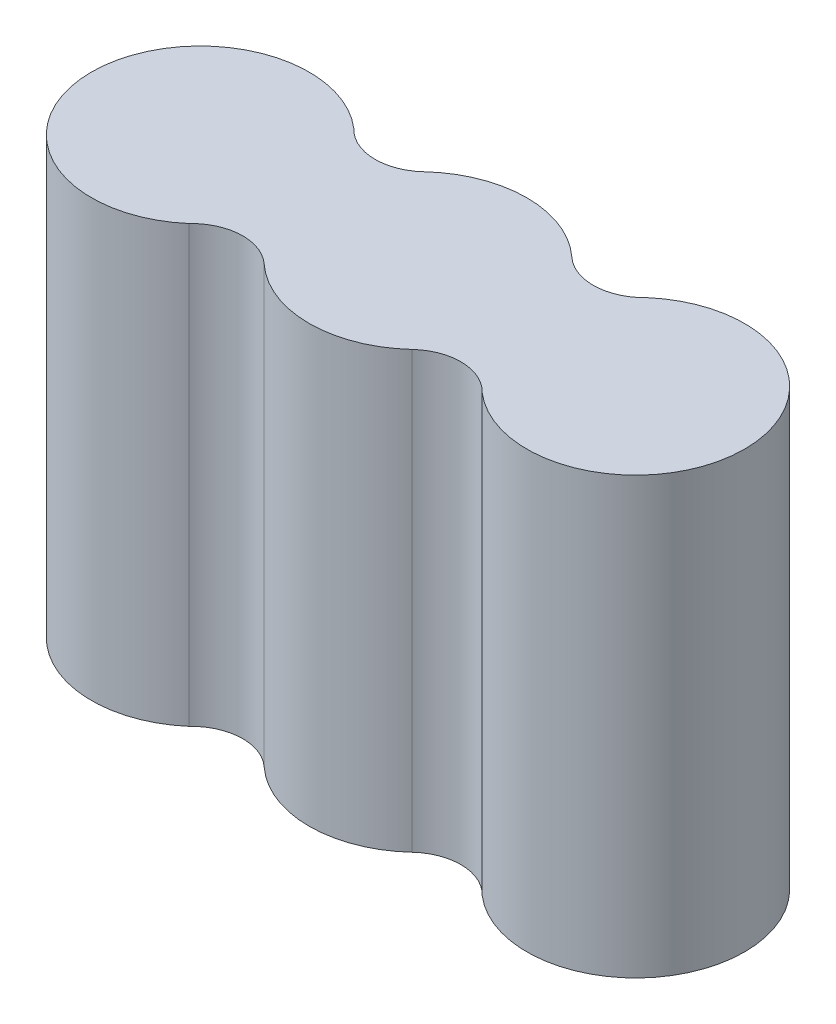
ISO-10303-21;
HEADER;
FILE_DESCRIPTION(('STEP AP214'),'2;1');
FILE_NAME('part.step','',(''),(''),'','','');
FILE_SCHEMA(('AUTOMOTIVE_DESIGN { 1 0 10303 214 1 1 1 1 }'));
ENDSEC;
DATA;
#1=APPLICATION_CONTEXT('core data for automotive mechanical design processes');
#2=APPLICATION_PROTOCOL_DEFINITION('international standard','automotive_design',2000,#1);
#3=PRODUCT_CONTEXT('',#1,'mechanical');
#4=PRODUCT('Part','Part','',(#3));
#5=PRODUCT_RELATED_PRODUCT_CATEGORY('part','',(#4));
#6=PRODUCT_DEFINITION_FORMATION('','',#4);
#7=PRODUCT_DEFINITION_CONTEXT('part definition',#1,'design');
#8=PRODUCT_DEFINITION('design','',#6,#7);
#9=PRODUCT_DEFINITION_SHAPE('','',#8);
#10=(LENGTH_UNIT() NAMED_UNIT(*) SI_UNIT(.MILLI.,.METRE.));
#11=(NAMED_UNIT(*) PLANE_ANGLE_UNIT() SI_UNIT($,.RADIAN.));
#12=(NAMED_UNIT(*) SI_UNIT($,.STERADIAN.) SOLID_ANGLE_UNIT());
#13=UNCERTAINTY_MEASURE_WITH_UNIT(LENGTH_MEASURE(1.E-05),#10,'distance_accuracy_value','');
#14=(GEOMETRIC_REPRESENTATION_CONTEXT(3) GLOBAL_UNCERTAINTY_ASSIGNED_CONTEXT((#13)) GLOBAL_UNIT_ASSIGNED_CONTEXT((#10,
#11,#12)) REPRESENTATION_CONTEXT('',''));
#15=CARTESIAN_POINT('',(0.,0.,0.));
#16=DIRECTION('',(0.,0.,1.));
#17=DIRECTION('',(1.,0.,0.));
#18=AXIS2_PLACEMENT_3D('',#15,#16,#17);
#19=CARTESIAN_POINT('',(7.50917892734011,30.,8.11492651155154));
#20=DIRECTION('',(0.,-1.,0.));
#21=DIRECTION('',(0.,0.,-1.));
#22=AXIS2_PLACEMENT_3D('',#19,#20,#21);
#23=CYLINDRICAL_SURFACE('',#22,3.55621094456377);
#24=CARTESIAN_POINT('',(7.50917892734011,0.,8.11492651155154));
#25=DIRECTION('',(0.,-1.,0.));
#26=DIRECTION('',(0.,0.,-1.));
#27=AXIS2_PLACEMENT_3D('',#24,#25,#26);
#28=CIRCLE('',#27,3.55621094456377);
#29=CARTESIAN_POINT('',(5.09386463748164,0.,5.504774568955));
#30=VERTEX_POINT('',#29);
#31=CARTESIAN_POINT('',(10.0956544191454,0.,5.67427479274238));
#32=VERTEX_POINT('',#31);
#33=EDGE_CURVE('E129',#30,#32,#28,.T.);
#34=ORIENTED_EDGE('',*,*,#33,.T.);
#35=DIRECTION('',(0.,-1.,0.));
#36=VECTOR('',#35,1.);
#37=CARTESIAN_POINT('',(10.0956544191454,30.,5.67427479274238));
#38=LINE('',#37,#36);
#39=CARTESIAN_POINT('',(10.0956544191454,30.,5.67427479274238));
#40=VERTEX_POINT('',#39);
#41=EDGE_CURVE('E11',#40,#32,#38,.T.);
#42=ORIENTED_EDGE('',*,*,#41,.F.);
#43=CARTESIAN_POINT('',(7.50917892734011,30.,8.11492651155154));
#44=DIRECTION('',(0.,-1.,0.));
#45=DIRECTION('',(0.,0.,-1.));
#46=AXIS2_PLACEMENT_3D('',#43,#44,#45);
#47=CIRCLE('',#46,3.55621094456377);
#48=CARTESIAN_POINT('',(5.09386463748164,30.,5.504774568955));
#49=VERTEX_POINT('',#48);
#50=EDGE_CURVE('E143',#49,#40,#47,.T.);
#51=ORIENTED_EDGE('',*,*,#50,.F.);
#52=DIRECTION('',(0.,-1.,0.));
#53=VECTOR('',#52,1.);
#54=CARTESIAN_POINT('',(5.09386463748164,30.,5.504774568955));
#55=LINE('',#54,#53);
#56=EDGE_CURVE('E125',#49,#30,#55,.T.);
#57=ORIENTED_EDGE('',*,*,#56,.T.);
#58=EDGE_LOOP('',(#34,#42,#51,#57));
#59=FACE_BOUND('',#58,.T.);
#60=ADVANCED_FACE('F33',(#59),#23,.F.);
#61=CARTESIAN_POINT('',(15.,30.,0.));
#62=DIRECTION('',(0.,-1.,0.));
#63=DIRECTION('',(0.,0.,-1.));
#64=AXIS2_PLACEMENT_3D('',#61,#62,#63);
#65=CYLINDRICAL_SURFACE('',#64,7.5);
#66=CARTESIAN_POINT('',(15.,0.,0.));
#67=DIRECTION('',(0.,1.,0.));
#68=DIRECTION('',(0.,0.,1.));
#69=AXIS2_PLACEMENT_3D('',#66,#67,#68);
#70=CIRCLE('',#69,7.5);
#71=CARTESIAN_POINT('',(10.0956544191453,0.,-5.67427479274239));
#72=VERTEX_POINT('',#71);
#73=EDGE_CURVE('E132',#32,#72,#70,.T.);
#74=ORIENTED_EDGE('',*,*,#73,.T.);
#75=DIRECTION('',(0.,-1.,0.));
#76=VECTOR('',#75,1.);
#77=CARTESIAN_POINT('',(10.0956544191453,30.,-5.67427479274239));
#78=LINE('',#77,#76);
#79=CARTESIAN_POINT('',(10.0956544191453,30.,-5.67427479274239));
#80=VERTEX_POINT('',#79);
#81=EDGE_CURVE('E41',#80,#72,#78,.T.);
#82=ORIENTED_EDGE('',*,*,#81,.F.);
#83=CARTESIAN_POINT('',(15.,30.,0.));
#84=DIRECTION('',(0.,1.,0.));
#85=DIRECTION('',(0.,0.,1.));
#86=AXIS2_PLACEMENT_3D('',#83,#84,#85);
#87=CIRCLE('',#86,7.5);
#88=EDGE_CURVE('E92',#40,#80,#87,.T.);
#89=ORIENTED_EDGE('',*,*,#88,.F.);
#90=ORIENTED_EDGE('',*,*,#41,.T.);
#91=EDGE_LOOP('',(#74,#82,#89,#90));
#92=FACE_BOUND('',#91,.T.);
#93=ADVANCED_FACE('F178',(#92),#65,.T.);
#94=CARTESIAN_POINT('',(7.50917892734011,30.,-8.11492651155154));
#95=DIRECTION('',(0.,-1.,0.));
#96=DIRECTION('',(0.,0.,-1.));
#97=AXIS2_PLACEMENT_3D('',#94,#95,#96);
#98=CYLINDRICAL_SURFACE('',#97,3.55621094456377);
#99=CARTESIAN_POINT('',(7.50917892734011,0.,-8.11492651155154));
#100=DIRECTION('',(0.,-1.,0.));
#101=DIRECTION('',(0.,0.,1.));
#102=AXIS2_PLACEMENT_3D('',#99,#100,#101);
#103=CIRCLE('',#102,3.55621094456377);
#104=CARTESIAN_POINT('',(5.09386463748164,0.,-5.504774568955));
#105=VERTEX_POINT('',#104);
#106=EDGE_CURVE('E134',#72,#105,#103,.T.);
#107=ORIENTED_EDGE('',*,*,#106,.T.);
#108=DIRECTION('',(0.,-1.,0.));
#109=VECTOR('',#108,1.);
#110=CARTESIAN_POINT('',(5.09386463748164,30.,-5.504774568955));
#111=LINE('',#110,#109);
#112=CARTESIAN_POINT('',(5.09386463748164,30.,-5.504774568955));
#113=VERTEX_POINT('',#112);
#114=EDGE_CURVE('E150',#113,#105,#111,.T.);
#115=ORIENTED_EDGE('',*,*,#114,.F.);
#116=CARTESIAN_POINT('',(7.50917892734011,30.,-8.11492651155154));
#117=DIRECTION('',(0.,-1.,0.));
#118=DIRECTION('',(0.,0.,1.));
#119=AXIS2_PLACEMENT_3D('',#116,#117,#118);
#120=CIRCLE('',#119,3.55621094456377);
#121=EDGE_CURVE('E158',#80,#113,#120,.T.);
#122=ORIENTED_EDGE('',*,*,#121,.F.);
#123=ORIENTED_EDGE('',*,*,#81,.T.);
#124=EDGE_LOOP('',(#107,#115,#122,#123));
#125=FACE_BOUND('',#124,.T.);
#126=ADVANCED_FACE('F156',(#125),#98,.F.);
#127=CARTESIAN_POINT('',(0.,30.,0.));
#128=DIRECTION('',(0.,-1.,0.));
#129=DIRECTION('',(0.,0.,-1.));
#130=AXIS2_PLACEMENT_3D('',#127,#128,#129);
#131=CYLINDRICAL_SURFACE('',#130,7.49999999999998);
#132=CARTESIAN_POINT('',(0.,0.,0.));
#133=DIRECTION('',(0.,1.,0.));
#134=DIRECTION('',(0.,0.,1.));
#135=AXIS2_PLACEMENT_3D('',#132,#133,#134);
#136=CIRCLE('',#135,7.49999999999998);
#137=CARTESIAN_POINT('',(-5.09386463748162,0.,-5.50477456895498));
#138=VERTEX_POINT('',#137);
#139=EDGE_CURVE('E136',#105,#138,#136,.T.);
#140=ORIENTED_EDGE('',*,*,#139,.T.);
#141=DIRECTION('',(0.,-1.,0.));
#142=VECTOR('',#141,1.);
#143=CARTESIAN_POINT('',(-5.09386463748162,30.,-5.50477456895498));
#144=LINE('',#143,#142);
#145=CARTESIAN_POINT('',(-5.09386463748162,30.,-5.50477456895498));
#146=VERTEX_POINT('',#145);
#147=EDGE_CURVE('E147',#146,#138,#144,.T.);
#148=ORIENTED_EDGE('',*,*,#147,.F.);
#149=CARTESIAN_POINT('',(0.,30.,0.));
#150=DIRECTION('',(0.,1.,0.));
#151=DIRECTION('',(0.,0.,1.));
#152=AXIS2_PLACEMENT_3D('',#149,#150,#151);
#153=CIRCLE('',#152,7.49999999999998);
#154=EDGE_CURVE('E170',#113,#146,#153,.T.);
#155=ORIENTED_EDGE('',*,*,#154,.F.);
#156=ORIENTED_EDGE('',*,*,#114,.T.);
#157=EDGE_LOOP('',(#140,#148,#155,#156));
#158=FACE_BOUND('',#157,.T.);
#159=ADVANCED_FACE('F166',(#158),#131,.T.);
#160=CARTESIAN_POINT('',(-7.50917892734011,30.,-8.11492651155153));
#161=DIRECTION('',(0.,-1.,0.));
#162=DIRECTION('',(0.,0.,-1.));
#163=AXIS2_PLACEMENT_3D('',#160,#161,#162);
#164=CYLINDRICAL_SURFACE('',#163,3.55621094456377);
#165=CARTESIAN_POINT('',(-7.50917892734011,0.,-8.11492651155153));
#166=DIRECTION('',(0.,-1.,0.));
#167=DIRECTION('',(0.,0.,-1.));
#168=AXIS2_PLACEMENT_3D('',#165,#166,#167);
#169=CIRCLE('',#168,3.55621094456377);
#170=CARTESIAN_POINT('',(-10.0956544191454,0.,-5.67427479274238));
#171=VERTEX_POINT('',#170);
#172=EDGE_CURVE('E138',#138,#171,#169,.T.);
#173=ORIENTED_EDGE('',*,*,#172,.T.);
#174=DIRECTION('',(0.,-1.,0.));
#175=VECTOR('',#174,1.);
#176=CARTESIAN_POINT('',(-10.0956544191454,30.,-5.67427479274238));
#177=LINE('',#176,#175);
#178=CARTESIAN_POINT('',(-10.0956544191454,30.,-5.67427479274238));
#179=VERTEX_POINT('',#178);
#180=EDGE_CURVE('E120',#179,#171,#177,.T.);
#181=ORIENTED_EDGE('',*,*,#180,.F.);
#182=CARTESIAN_POINT('',(-7.50917892734011,30.,-8.11492651155153));
#183=DIRECTION('',(0.,-1.,0.));
#184=DIRECTION('',(0.,0.,-1.));
#185=AXIS2_PLACEMENT_3D('',#182,#183,#184);
#186=CIRCLE('',#185,3.55621094456377);
#187=EDGE_CURVE('E111',#146,#179,#186,.T.);
#188=ORIENTED_EDGE('',*,*,#187,.F.);
#189=ORIENTED_EDGE('',*,*,#147,.T.);
#190=EDGE_LOOP('',(#173,#181,#188,#189));
#191=FACE_BOUND('',#190,.T.);
#192=ADVANCED_FACE('F169',(#191),#164,.F.);
#193=CARTESIAN_POINT('',(-15.,30.,0.));
#194=DIRECTION('',(0.,-1.,0.));
#195=DIRECTION('',(0.,0.,-1.));
#196=AXIS2_PLACEMENT_3D('',#193,#194,#195);
#197=CYLINDRICAL_SURFACE('',#196,7.5);
#198=CARTESIAN_POINT('',(-15.,0.,0.));
#199=DIRECTION('',(0.,1.,0.));
#200=DIRECTION('',(0.,0.,-1.));
#201=AXIS2_PLACEMENT_3D('',#198,#199,#200);
#202=CIRCLE('',#201,7.5);
#203=CARTESIAN_POINT('',(-10.0956544191453,0.,5.67427479274239));
#204=VERTEX_POINT('',#203);
#205=EDGE_CURVE('E119',#171,#204,#202,.T.);
#206=ORIENTED_EDGE('',*,*,#205,.T.);
#207=DIRECTION('',(0.,-1.,0.));
#208=VECTOR('',#207,1.);
#209=CARTESIAN_POINT('',(-10.0956544191453,30.,5.67427479274239));
#210=LINE('',#209,#208);
#211=CARTESIAN_POINT('',(-10.0956544191453,30.,5.67427479274239));
#212=VERTEX_POINT('',#211);
#213=EDGE_CURVE('E116',#212,#204,#210,.T.);
#214=ORIENTED_EDGE('',*,*,#213,.F.);
#215=CARTESIAN_POINT('',(-15.,30.,0.));
#216=DIRECTION('',(0.,1.,0.));
#217=DIRECTION('',(0.,0.,-1.));
#218=AXIS2_PLACEMENT_3D('',#215,#216,#217);
#219=CIRCLE('',#218,7.5);
#220=EDGE_CURVE('E105',#179,#212,#219,.T.);
#221=ORIENTED_EDGE('',*,*,#220,.F.);
#222=ORIENTED_EDGE('',*,*,#180,.T.);
#223=EDGE_LOOP('',(#206,#214,#221,#222));
#224=FACE_BOUND('',#223,.T.);
#225=ADVANCED_FACE('F117',(#224),#197,.T.);
#226=CARTESIAN_POINT('',(-7.50917892734011,30.,8.11492651155153));
#227=DIRECTION('',(0.,-1.,0.));
#228=DIRECTION('',(0.,0.,-1.));
#229=AXIS2_PLACEMENT_3D('',#226,#227,#228);
#230=CYLINDRICAL_SURFACE('',#229,3.55621094456377);
#231=CARTESIAN_POINT('',(-7.50917892734011,0.,8.11492651155153));
#232=DIRECTION('',(0.,-1.,0.));
#233=DIRECTION('',(0.,0.,1.));
#234=AXIS2_PLACEMENT_3D('',#231,#232,#233);
#235=CIRCLE('',#234,3.55621094456377);
#236=CARTESIAN_POINT('',(-5.09386463748164,0.,5.504774568955));
#237=VERTEX_POINT('',#236);
#238=EDGE_CURVE('E78',#204,#237,#235,.T.);
#239=ORIENTED_EDGE('',*,*,#238,.T.);
#240=DIRECTION('',(0.,-1.,0.));
#241=VECTOR('',#240,1.);
#242=CARTESIAN_POINT('',(-5.09386463748164,30.,5.504774568955));
#243=LINE('',#242,#241);
#244=CARTESIAN_POINT('',(-5.09386463748164,30.,5.504774568955));
#245=VERTEX_POINT('',#244);
#246=EDGE_CURVE('E121',#245,#237,#243,.T.);
#247=ORIENTED_EDGE('',*,*,#246,.F.);
#248=CARTESIAN_POINT('',(-7.50917892734011,30.,8.11492651155153));
#249=DIRECTION('',(0.,-1.,0.));
#250=DIRECTION('',(0.,0.,1.));
#251=AXIS2_PLACEMENT_3D('',#248,#249,#250);
#252=CIRCLE('',#251,3.55621094456377);
#253=EDGE_CURVE('E109',#212,#245,#252,.T.);
#254=ORIENTED_EDGE('',*,*,#253,.F.);
#255=ORIENTED_EDGE('',*,*,#213,.T.);
#256=EDGE_LOOP('',(#239,#247,#254,#255));
#257=FACE_BOUND('',#256,.T.);
#258=ADVANCED_FACE('F123',(#257),#230,.F.);
#259=CARTESIAN_POINT('',(0.,30.,0.));
#260=DIRECTION('',(0.,-1.,0.));
#261=DIRECTION('',(0.,0.,-1.));
#262=AXIS2_PLACEMENT_3D('',#259,#260,#261);
#263=CYLINDRICAL_SURFACE('',#262,7.49999999999998);
#264=CARTESIAN_POINT('',(0.,0.,0.));
#265=DIRECTION('',(0.,1.,0.));
#266=DIRECTION('',(0.,0.,-1.));
#267=AXIS2_PLACEMENT_3D('',#264,#265,#266);
#268=CIRCLE('',#267,7.49999999999998);
#269=EDGE_CURVE('E84',#237,#30,#268,.T.);
#270=ORIENTED_EDGE('',*,*,#269,.T.);
#271=ORIENTED_EDGE('',*,*,#56,.F.);
#272=CARTESIAN_POINT('',(0.,30.,0.));
#273=DIRECTION('',(0.,1.,0.));
#274=DIRECTION('',(0.,0.,-1.));
#275=AXIS2_PLACEMENT_3D('',#272,#273,#274);
#276=CIRCLE('',#275,7.49999999999998);
#277=EDGE_CURVE('E49',#245,#49,#276,.T.);
#278=ORIENTED_EDGE('',*,*,#277,.F.);
#279=ORIENTED_EDGE('',*,*,#246,.T.);
#280=EDGE_LOOP('',(#270,#271,#278,#279));
#281=FACE_BOUND('',#280,.T.);
#282=ADVANCED_FACE('F194',(#281),#263,.T.);
#283=CARTESIAN_POINT('',(11.2545894636701,30.,4.05746325577577));
#284=DIRECTION('',(0.,-1.,0.));
#285=DIRECTION('',(0.,0.,-1.));
#286=AXIS2_PLACEMENT_3D('',#283,#284,#285);
#287=PLANE('',#286);
#288=ORIENTED_EDGE('',*,*,#50,.T.);
#289=ORIENTED_EDGE('',*,*,#88,.T.);
#290=ORIENTED_EDGE('',*,*,#121,.T.);
#291=ORIENTED_EDGE('',*,*,#154,.T.);
#292=ORIENTED_EDGE('',*,*,#187,.T.);
#293=ORIENTED_EDGE('',*,*,#220,.T.);
#294=ORIENTED_EDGE('',*,*,#253,.T.);
#295=ORIENTED_EDGE('',*,*,#277,.T.);
#296=EDGE_LOOP('',(#288,#289,#290,#291,#292,#293,#294,#295));
#297=FACE_BOUND('',#296,.T.);
#298=ADVANCED_FACE('F107',(#297),#287,.F.);
#299=CARTESIAN_POINT('',(11.2545894636701,0.,4.05746325577577));
#300=DIRECTION('',(0.,-1.,0.));
#301=DIRECTION('',(0.,0.,-1.));
#302=AXIS2_PLACEMENT_3D('',#299,#300,#301);
#303=PLANE('',#302);
#304=ORIENTED_EDGE('',*,*,#33,.F.);
#305=ORIENTED_EDGE('',*,*,#269,.F.);
#306=ORIENTED_EDGE('',*,*,#238,.F.);
#307=ORIENTED_EDGE('',*,*,#205,.F.);
#308=ORIENTED_EDGE('',*,*,#172,.F.);
#309=ORIENTED_EDGE('',*,*,#139,.F.);
#310=ORIENTED_EDGE('',*,*,#106,.F.);
#311=ORIENTED_EDGE('',*,*,#73,.F.);
#312=EDGE_LOOP('',(#304,#305,#306,#307,#308,#309,#310,#311));
#313=FACE_BOUND('',#312,.T.);
#314=ADVANCED_FACE('F162',(#313),#303,.T.);
#315=CLOSED_SHELL('',(#60,#93,#126,#159,#192,#225,#258,#282,#298,#314));
#316=MANIFOLD_SOLID_BREP('B2',#315);
#317=ADVANCED_BREP_SHAPE_REPRESENTATION('',(#18,#316),#14);
#318=SHAPE_DEFINITION_REPRESENTATION(#9,#317);
ENDSEC;
END-ISO-10303-21;
